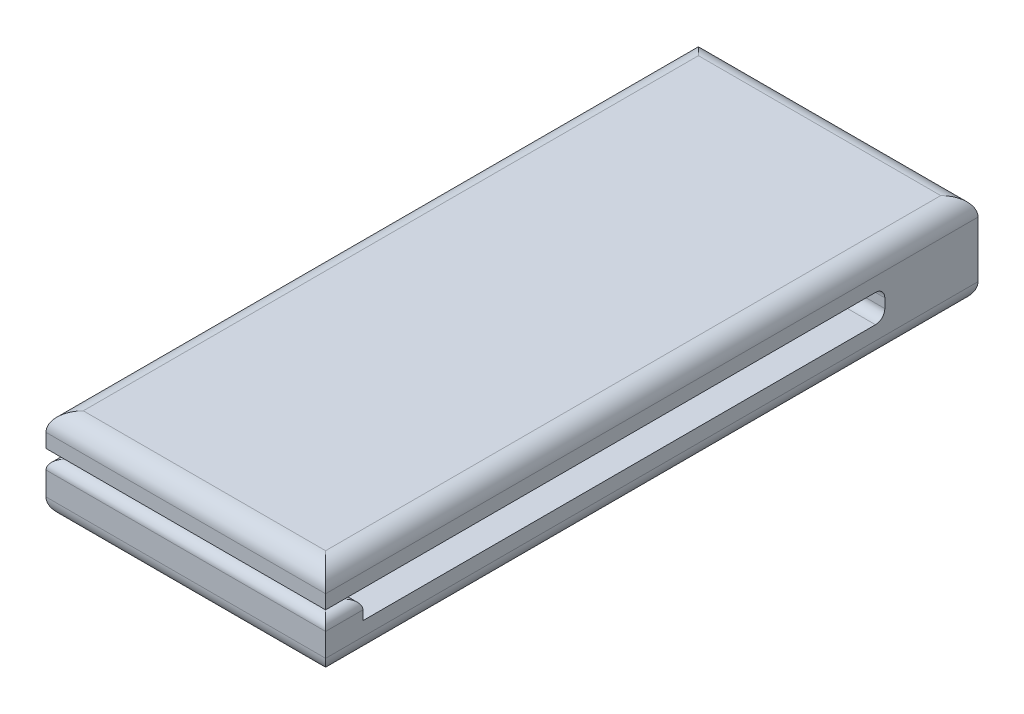
ISO-10303-21;
HEADER;
FILE_DESCRIPTION(('STEP AP214'),'2;1');
FILE_NAME('part.step','',(''),(''),'','','');
FILE_SCHEMA(('AUTOMOTIVE_DESIGN { 1 0 10303 214 1 1 1 1 }'));
ENDSEC;
DATA;
#1=APPLICATION_CONTEXT('core data for automotive mechanical design processes');
#2=APPLICATION_PROTOCOL_DEFINITION('international standard','automotive_design',2000,#1);
#3=PRODUCT_CONTEXT('',#1,'mechanical');
#4=PRODUCT('Part','Part','',(#3));
#5=PRODUCT_RELATED_PRODUCT_CATEGORY('part','',(#4));
#6=PRODUCT_DEFINITION_FORMATION('','',#4);
#7=PRODUCT_DEFINITION_CONTEXT('part definition',#1,'design');
#8=PRODUCT_DEFINITION('design','',#6,#7);
#9=PRODUCT_DEFINITION_SHAPE('','',#8);
#10=(LENGTH_UNIT() NAMED_UNIT(*) SI_UNIT(.MILLI.,.METRE.));
#11=(NAMED_UNIT(*) PLANE_ANGLE_UNIT() SI_UNIT($,.RADIAN.));
#12=(NAMED_UNIT(*) SI_UNIT($,.STERADIAN.) SOLID_ANGLE_UNIT());
#13=UNCERTAINTY_MEASURE_WITH_UNIT(LENGTH_MEASURE(1.E-05),#10,'distance_accuracy_value','');
#14=(GEOMETRIC_REPRESENTATION_CONTEXT(3) GLOBAL_UNCERTAINTY_ASSIGNED_CONTEXT((#13)) GLOBAL_UNIT_ASSIGNED_CONTEXT((#10,
#11,#12)) REPRESENTATION_CONTEXT('',''));
#15=CARTESIAN_POINT('',(0.,0.,0.));
#16=DIRECTION('',(0.,0.,1.));
#17=DIRECTION('',(1.,0.,0.));
#18=AXIS2_PLACEMENT_3D('',#15,#16,#17);
#19=CARTESIAN_POINT('',(-7.5,5.,17.5));
#20=DIRECTION('',(0.,0.,-1.));
#21=DIRECTION('',(-1.,0.,0.));
#22=AXIS2_PLACEMENT_3D('',#19,#20,#21);
#23=PLANE('',#22);
#24=DIRECTION('',(0.,-1.,0.));
#25=VECTOR('',#24,1.);
#26=CARTESIAN_POINT('',(7.5,5.,17.5));
#27=LINE('',#26,#25);
#28=CARTESIAN_POINT('',(7.5,2.25,17.5));
#29=VERTEX_POINT('',#28);
#30=CARTESIAN_POINT('',(7.5,1.,17.5));
#31=VERTEX_POINT('',#30);
#32=EDGE_CURVE('E363',#29,#31,#27,.T.);
#33=ORIENTED_EDGE('',*,*,#32,.F.);
#34=DIRECTION('',(1.,0.,0.));
#35=VECTOR('',#34,1.);
#36=CARTESIAN_POINT('',(-7.5,2.25,17.5));
#37=LINE('',#36,#35);
#38=CARTESIAN_POINT('',(-7.5,2.25,17.5));
#39=VERTEX_POINT('',#38);
#40=EDGE_CURVE('E329',#29,#39,#37,.F.);
#41=ORIENTED_EDGE('',*,*,#40,.T.);
#42=DIRECTION('',(0.,-1.,0.));
#43=VECTOR('',#42,1.);
#44=CARTESIAN_POINT('',(-7.5,5.,17.5));
#45=LINE('',#44,#43);
#46=CARTESIAN_POINT('',(-7.5,1.,17.5));
#47=VERTEX_POINT('',#46);
#48=EDGE_CURVE('E193',#39,#47,#45,.T.);
#49=ORIENTED_EDGE('',*,*,#48,.T.);
#50=DIRECTION('',(1.,0.,0.));
#51=VECTOR('',#50,1.);
#52=CARTESIAN_POINT('',(7.5,1.,17.5));
#53=LINE('',#52,#51);
#54=EDGE_CURVE('E269',#47,#31,#53,.T.);
#55=ORIENTED_EDGE('',*,*,#54,.T.);
#56=EDGE_LOOP('',(#33,#41,#49,#55));
#57=FACE_BOUND('',#56,.T.);
#58=ADVANCED_FACE('F39',(#57),#23,.F.);
#59=CARTESIAN_POINT('',(7.5,1.75,-12.5));
#60=DIRECTION('',(0.,-1.,0.));
#61=DIRECTION('',(1.,0.,0.));
#62=AXIS2_PLACEMENT_3D('',#59,#60,#61);
#63=PLANE('',#62);
#64=DIRECTION('',(-1.,0.,0.));
#65=VECTOR('',#64,1.);
#66=CARTESIAN_POINT('',(-7.5,1.75,15.5));
#67=LINE('',#66,#65);
#68=CARTESIAN_POINT('',(7.5,1.75,15.5));
#69=VERTEX_POINT('',#68);
#70=CARTESIAN_POINT('',(-7.5,1.75,15.5));
#71=VERTEX_POINT('',#70);
#72=EDGE_CURVE('E185',#69,#71,#67,.T.);
#73=ORIENTED_EDGE('',*,*,#72,.F.);
#74=DIRECTION('',(0.,0.,1.));
#75=VECTOR('',#74,1.);
#76=CARTESIAN_POINT('',(7.5,1.75,-12.5));
#77=LINE('',#76,#75);
#78=CARTESIAN_POINT('',(7.5,1.75,-12.));
#79=VERTEX_POINT('',#78);
#80=EDGE_CURVE('E651',#79,#69,#77,.T.);
#81=ORIENTED_EDGE('',*,*,#80,.F.);
#82=DIRECTION('',(1.,0.,0.));
#83=VECTOR('',#82,1.);
#84=CARTESIAN_POINT('',(-7.5,1.75,-12.));
#85=LINE('',#84,#83);
#86=CARTESIAN_POINT('',(-7.5,1.75,-12.));
#87=VERTEX_POINT('',#86);
#88=EDGE_CURVE('E307',#79,#87,#85,.F.);
#89=ORIENTED_EDGE('',*,*,#88,.T.);
#90=DIRECTION('',(0.,0.,1.));
#91=VECTOR('',#90,1.);
#92=CARTESIAN_POINT('',(-7.5,1.75,-12.5));
#93=LINE('',#92,#91);
#94=EDGE_CURVE('E175',#87,#71,#93,.T.);
#95=ORIENTED_EDGE('',*,*,#94,.T.);
#96=EDGE_LOOP('',(#73,#81,#89,#95));
#97=FACE_BOUND('',#96,.T.);
#98=ADVANCED_FACE('F385',(#97),#63,.F.);
#99=CARTESIAN_POINT('',(-7.5,3.25,-12.5));
#100=DIRECTION('',(0.,1.,0.));
#101=DIRECTION('',(0.,0.,1.));
#102=AXIS2_PLACEMENT_3D('',#99,#100,#101);
#103=PLANE('',#102);
#104=DIRECTION('',(0.,0.,1.));
#105=VECTOR('',#104,1.);
#106=CARTESIAN_POINT('',(7.5,3.25,-12.5));
#107=LINE('',#106,#105);
#108=CARTESIAN_POINT('',(7.5,3.25,-12.));
#109=VERTEX_POINT('',#108);
#110=CARTESIAN_POINT('',(7.5,3.25,17.5));
#111=VERTEX_POINT('',#110);
#112=EDGE_CURVE('E176',#109,#111,#107,.T.);
#113=ORIENTED_EDGE('',*,*,#112,.T.);
#114=DIRECTION('',(1.,0.,0.));
#115=VECTOR('',#114,1.);
#116=CARTESIAN_POINT('',(-7.5,3.25,17.5));
#117=LINE('',#116,#115);
#118=CARTESIAN_POINT('',(-7.5,3.25,17.5));
#119=VERTEX_POINT('',#118);
#120=EDGE_CURVE('E179',#119,#111,#117,.T.);
#121=ORIENTED_EDGE('',*,*,#120,.F.);
#122=DIRECTION('',(0.,0.,1.));
#123=VECTOR('',#122,1.);
#124=CARTESIAN_POINT('',(-7.5,3.25,-12.5));
#125=LINE('',#124,#123);
#126=CARTESIAN_POINT('',(-7.5,3.25,-12.));
#127=VERTEX_POINT('',#126);
#128=EDGE_CURVE('E164',#127,#119,#125,.T.);
#129=ORIENTED_EDGE('',*,*,#128,.F.);
#130=DIRECTION('',(-1.,0.,0.));
#131=VECTOR('',#130,1.);
#132=CARTESIAN_POINT('',(7.5,3.25,-12.));
#133=LINE('',#132,#131);
#134=EDGE_CURVE('E294',#127,#109,#133,.F.);
#135=ORIENTED_EDGE('',*,*,#134,.T.);
#136=EDGE_LOOP('',(#113,#121,#129,#135));
#137=FACE_BOUND('',#136,.T.);
#138=ADVANCED_FACE('F180',(#137),#103,.F.);
#139=CARTESIAN_POINT('',(7.5,5.,17.5));
#140=DIRECTION('',(-1.,0.,0.));
#141=DIRECTION('',(0.,0.,1.));
#142=AXIS2_PLACEMENT_3D('',#139,#140,#141);
#143=PLANE('',#142);
#144=DIRECTION('',(0.,-1.,0.));
#145=VECTOR('',#144,1.);
#146=CARTESIAN_POINT('',(7.5,3.25,15.5));
#147=LINE('',#146,#145);
#148=CARTESIAN_POINT('',(7.5,2.25,15.5));
#149=VERTEX_POINT('',#148);
#150=EDGE_CURVE('E281',#149,#69,#147,.T.);
#151=ORIENTED_EDGE('',*,*,#150,.F.);
#152=DIRECTION('',(0.,0.,-1.));
#153=VECTOR('',#152,1.);
#154=CARTESIAN_POINT('',(7.5,2.25,17.5));
#155=LINE('',#154,#153);
#156=EDGE_CURVE('E11',#149,#29,#155,.F.);
#157=ORIENTED_EDGE('',*,*,#156,.T.);
#158=ORIENTED_EDGE('',*,*,#32,.T.);
#159=DIRECTION('',(0.,0.,-1.));
#160=VECTOR('',#159,1.);
#161=CARTESIAN_POINT('',(7.5,1.,-17.5));
#162=LINE('',#161,#160);
#163=CARTESIAN_POINT('',(7.5,1.,-17.5));
#164=VERTEX_POINT('',#163);
#165=EDGE_CURVE('E273',#31,#164,#162,.T.);
#166=ORIENTED_EDGE('',*,*,#165,.T.);
#167=DIRECTION('',(0.,-1.,0.));
#168=VECTOR('',#167,1.);
#169=CARTESIAN_POINT('',(7.5,5.,-17.5));
#170=LINE('',#169,#168);
#171=CARTESIAN_POINT('',(7.5,4.,-17.5));
#172=VERTEX_POINT('',#171);
#173=EDGE_CURVE('E198',#172,#164,#170,.T.);
#174=ORIENTED_EDGE('',*,*,#173,.F.);
#175=DIRECTION('',(0.,0.,-1.));
#176=VECTOR('',#175,1.);
#177=CARTESIAN_POINT('',(7.5,4.,17.5));
#178=LINE('',#177,#176);
#179=CARTESIAN_POINT('',(7.5,4.,17.5));
#180=VERTEX_POINT('',#179);
#181=EDGE_CURVE('E228',#172,#180,#178,.F.);
#182=ORIENTED_EDGE('',*,*,#181,.T.);
#183=EDGE_CURVE('E200',#180,#111,#27,.T.);
#184=ORIENTED_EDGE('',*,*,#183,.T.);
#185=ORIENTED_EDGE('',*,*,#112,.F.);
#186=CARTESIAN_POINT('',(7.5,2.75,-12.));
#187=DIRECTION('',(-1.,0.,0.));
#188=DIRECTION('',(0.,0.,1.));
#189=AXIS2_PLACEMENT_3D('',#186,#187,#188);
#190=CIRCLE('',#189,0.5);
#191=CARTESIAN_POINT('',(7.5,2.75,-12.5));
#192=VERTEX_POINT('',#191);
#193=EDGE_CURVE('E299',#109,#192,#190,.T.);
#194=ORIENTED_EDGE('',*,*,#193,.T.);
#195=DIRECTION('',(0.,1.,0.));
#196=VECTOR('',#195,1.);
#197=CARTESIAN_POINT('',(7.5,3.25,-12.5));
#198=LINE('',#197,#196);
#199=CARTESIAN_POINT('',(7.5,2.25,-12.5));
#200=VERTEX_POINT('',#199);
#201=EDGE_CURVE('E248',#200,#192,#198,.T.);
#202=ORIENTED_EDGE('',*,*,#201,.F.);
#203=CARTESIAN_POINT('',(7.5,2.25,-12.));
#204=DIRECTION('',(-1.,0.,0.));
#205=DIRECTION('',(0.,0.,1.));
#206=AXIS2_PLACEMENT_3D('',#203,#204,#205);
#207=CIRCLE('',#206,0.5);
#208=EDGE_CURVE('E310',#200,#79,#207,.T.);
#209=ORIENTED_EDGE('',*,*,#208,.T.);
#210=ORIENTED_EDGE('',*,*,#80,.T.);
#211=EDGE_LOOP('',(#151,#157,#158,#166,#174,#182,#184,#185,#194,#202,#209,#210));
#212=FACE_BOUND('',#211,.T.);
#213=ADVANCED_FACE('F362',(#212),#143,.F.);
#214=CARTESIAN_POINT('',(-7.5,5.,-17.5));
#215=DIRECTION('',(0.,0.,1.));
#216=DIRECTION('',(1.,0.,0.));
#217=AXIS2_PLACEMENT_3D('',#214,#215,#216);
#218=PLANE('',#217);
#219=ORIENTED_EDGE('',*,*,#173,.T.);
#220=DIRECTION('',(-1.,0.,0.));
#221=VECTOR('',#220,1.);
#222=CARTESIAN_POINT('',(-7.5,1.,-17.5));
#223=LINE('',#222,#221);
#224=CARTESIAN_POINT('',(-7.5,1.,-17.5));
#225=VERTEX_POINT('',#224);
#226=EDGE_CURVE('E232',#164,#225,#223,.T.);
#227=ORIENTED_EDGE('',*,*,#226,.T.);
#228=DIRECTION('',(0.,-1.,0.));
#229=VECTOR('',#228,1.);
#230=CARTESIAN_POINT('',(-7.5,5.,-17.5));
#231=LINE('',#230,#229);
#232=CARTESIAN_POINT('',(-7.5,4.,-17.5));
#233=VERTEX_POINT('',#232);
#234=EDGE_CURVE('E192',#233,#225,#231,.T.);
#235=ORIENTED_EDGE('',*,*,#234,.F.);
#236=DIRECTION('',(-1.,0.,0.));
#237=VECTOR('',#236,1.);
#238=CARTESIAN_POINT('',(-7.5,4.,-17.5));
#239=LINE('',#238,#237);
#240=EDGE_CURVE('E225',#233,#172,#239,.F.);
#241=ORIENTED_EDGE('',*,*,#240,.T.);
#242=EDGE_LOOP('',(#219,#227,#235,#241));
#243=FACE_BOUND('',#242,.T.);
#244=ADVANCED_FACE('F403',(#243),#218,.F.);
#245=CARTESIAN_POINT('',(-7.5,5.,17.5));
#246=DIRECTION('',(1.,0.,0.));
#247=DIRECTION('',(0.,0.,-1.));
#248=AXIS2_PLACEMENT_3D('',#245,#246,#247);
#249=PLANE('',#248);
#250=ORIENTED_EDGE('',*,*,#48,.F.);
#251=DIRECTION('',(0.,0.,-1.));
#252=VECTOR('',#251,1.);
#253=CARTESIAN_POINT('',(-7.5,2.25,17.5));
#254=LINE('',#253,#252);
#255=CARTESIAN_POINT('',(-7.5,2.25,15.5));
#256=VERTEX_POINT('',#255);
#257=EDGE_CURVE('E64',#39,#256,#254,.T.);
#258=ORIENTED_EDGE('',*,*,#257,.T.);
#259=DIRECTION('',(0.,-1.,0.));
#260=VECTOR('',#259,1.);
#261=CARTESIAN_POINT('',(-7.5,3.25,15.5));
#262=LINE('',#261,#260);
#263=EDGE_CURVE('E661',#256,#71,#262,.T.);
#264=ORIENTED_EDGE('',*,*,#263,.T.);
#265=ORIENTED_EDGE('',*,*,#94,.F.);
#266=CARTESIAN_POINT('',(-7.5,2.25,-12.));
#267=DIRECTION('',(1.,0.,0.));
#268=DIRECTION('',(0.,0.,-1.));
#269=AXIS2_PLACEMENT_3D('',#266,#267,#268);
#270=CIRCLE('',#269,0.5);
#271=CARTESIAN_POINT('',(-7.5,2.25,-12.5));
#272=VERTEX_POINT('',#271);
#273=EDGE_CURVE('E313',#87,#272,#270,.T.);
#274=ORIENTED_EDGE('',*,*,#273,.T.);
#275=DIRECTION('',(0.,-1.,0.));
#276=VECTOR('',#275,1.);
#277=CARTESIAN_POINT('',(-7.5,1.75,-12.5));
#278=LINE('',#277,#276);
#279=CARTESIAN_POINT('',(-7.5,2.75,-12.5));
#280=VERTEX_POINT('',#279);
#281=EDGE_CURVE('E654',#280,#272,#278,.T.);
#282=ORIENTED_EDGE('',*,*,#281,.F.);
#283=CARTESIAN_POINT('',(-7.5,2.75,-12.));
#284=DIRECTION('',(1.,0.,0.));
#285=DIRECTION('',(0.,0.,-1.));
#286=AXIS2_PLACEMENT_3D('',#283,#284,#285);
#287=CIRCLE('',#286,0.5);
#288=EDGE_CURVE('E171',#280,#127,#287,.T.);
#289=ORIENTED_EDGE('',*,*,#288,.T.);
#290=ORIENTED_EDGE('',*,*,#128,.T.);
#291=CARTESIAN_POINT('',(-7.5,4.,17.5));
#292=VERTEX_POINT('',#291);
#293=EDGE_CURVE('E168',#292,#119,#45,.T.);
#294=ORIENTED_EDGE('',*,*,#293,.F.);
#295=DIRECTION('',(0.,0.,1.));
#296=VECTOR('',#295,1.);
#297=CARTESIAN_POINT('',(-7.5,4.,17.5));
#298=LINE('',#297,#296);
#299=EDGE_CURVE('E222',#292,#233,#298,.F.);
#300=ORIENTED_EDGE('',*,*,#299,.T.);
#301=ORIENTED_EDGE('',*,*,#234,.T.);
#302=DIRECTION('',(0.,0.,1.));
#303=VECTOR('',#302,1.);
#304=CARTESIAN_POINT('',(-7.5,1.,17.5));
#305=LINE('',#304,#303);
#306=EDGE_CURVE('E265',#225,#47,#305,.T.);
#307=ORIENTED_EDGE('',*,*,#306,.T.);
#308=EDGE_LOOP('',(#250,#258,#264,#265,#274,#282,#289,#290,#294,#300,#301,#307));
#309=FACE_BOUND('',#308,.T.);
#310=ADVANCED_FACE('F166',(#309),#249,.F.);
#311=ORIENTED_EDGE('',*,*,#293,.T.);
#312=ORIENTED_EDGE('',*,*,#120,.T.);
#313=ORIENTED_EDGE('',*,*,#183,.F.);
#314=DIRECTION('',(1.,0.,0.));
#315=VECTOR('',#314,1.);
#316=CARTESIAN_POINT('',(-7.5,4.,17.5));
#317=LINE('',#316,#315);
#318=EDGE_CURVE('E190',#180,#292,#317,.F.);
#319=ORIENTED_EDGE('',*,*,#318,.T.);
#320=EDGE_LOOP('',(#311,#312,#313,#319));
#321=FACE_BOUND('',#320,.T.);
#322=ADVANCED_FACE('F188',(#321),#23,.F.);
#323=CARTESIAN_POINT('',(0.,5.,0.));
#324=DIRECTION('',(0.,-1.,0.));
#325=DIRECTION('',(0.,0.,-1.));
#326=AXIS2_PLACEMENT_3D('',#323,#324,#325);
#327=PLANE('',#326);
#328=DIRECTION('',(0.,0.,1.));
#329=VECTOR('',#328,1.);
#330=CARTESIAN_POINT('',(-6.5,5.,0.));
#331=LINE('',#330,#329);
#332=CARTESIAN_POINT('',(-6.5,5.,-16.5));
#333=VERTEX_POINT('',#332);
#334=CARTESIAN_POINT('',(-6.5,5.,16.5));
#335=VERTEX_POINT('',#334);
#336=EDGE_CURVE('E213',#333,#335,#331,.T.);
#337=ORIENTED_EDGE('',*,*,#336,.T.);
#338=DIRECTION('',(1.,0.,0.));
#339=VECTOR('',#338,1.);
#340=CARTESIAN_POINT('',(0.,5.,16.5));
#341=LINE('',#340,#339);
#342=CARTESIAN_POINT('',(6.5,5.,16.5));
#343=VERTEX_POINT('',#342);
#344=EDGE_CURVE('E216',#335,#343,#341,.T.);
#345=ORIENTED_EDGE('',*,*,#344,.T.);
#346=DIRECTION('',(0.,0.,-1.));
#347=VECTOR('',#346,1.);
#348=CARTESIAN_POINT('',(6.5,5.,0.));
#349=LINE('',#348,#347);
#350=CARTESIAN_POINT('',(6.5,5.,-16.5));
#351=VERTEX_POINT('',#350);
#352=EDGE_CURVE('E207',#343,#351,#349,.T.);
#353=ORIENTED_EDGE('',*,*,#352,.T.);
#354=DIRECTION('',(-1.,0.,0.));
#355=VECTOR('',#354,1.);
#356=CARTESIAN_POINT('',(0.,5.,-16.5));
#357=LINE('',#356,#355);
#358=EDGE_CURVE('E210',#351,#333,#357,.T.);
#359=ORIENTED_EDGE('',*,*,#358,.T.);
#360=EDGE_LOOP('',(#337,#345,#353,#359));
#361=FACE_BOUND('',#360,.T.);
#362=ADVANCED_FACE('F395',(#361),#327,.F.);
#363=CARTESIAN_POINT('',(0.,0.,0.));
#364=DIRECTION('',(0.,-1.,0.));
#365=DIRECTION('',(0.,0.,-1.));
#366=AXIS2_PLACEMENT_3D('',#363,#364,#365);
#367=PLANE('',#366);
#368=DIRECTION('',(0.,0.,1.));
#369=VECTOR('',#368,1.);
#370=CARTESIAN_POINT('',(-6.5,0.,-17.5));
#371=LINE('',#370,#369);
#372=CARTESIAN_POINT('',(-6.5,0.,16.5));
#373=VERTEX_POINT('',#372);
#374=CARTESIAN_POINT('',(-6.5,0.,-16.5));
#375=VERTEX_POINT('',#374);
#376=EDGE_CURVE('E258',#373,#375,#371,.F.);
#377=ORIENTED_EDGE('',*,*,#376,.T.);
#378=DIRECTION('',(-1.,0.,0.));
#379=VECTOR('',#378,1.);
#380=CARTESIAN_POINT('',(7.5,0.,-16.5));
#381=LINE('',#380,#379);
#382=CARTESIAN_POINT('',(6.5,0.,-16.5));
#383=VERTEX_POINT('',#382);
#384=EDGE_CURVE('E261',#375,#383,#381,.F.);
#385=ORIENTED_EDGE('',*,*,#384,.T.);
#386=DIRECTION('',(0.,0.,-1.));
#387=VECTOR('',#386,1.);
#388=CARTESIAN_POINT('',(6.5,0.,17.5));
#389=LINE('',#388,#387);
#390=CARTESIAN_POINT('',(6.5,0.,16.5));
#391=VERTEX_POINT('',#390);
#392=EDGE_CURVE('E252',#383,#391,#389,.F.);
#393=ORIENTED_EDGE('',*,*,#392,.T.);
#394=DIRECTION('',(1.,0.,0.));
#395=VECTOR('',#394,1.);
#396=CARTESIAN_POINT('',(-7.5,0.,16.5));
#397=LINE('',#396,#395);
#398=EDGE_CURVE('E255',#391,#373,#397,.F.);
#399=ORIENTED_EDGE('',*,*,#398,.T.);
#400=EDGE_LOOP('',(#377,#385,#393,#399));
#401=FACE_BOUND('',#400,.T.);
#402=ADVANCED_FACE('F400',(#401),#367,.T.);
#403=CARTESIAN_POINT('',(0.,0.,-12.5));
#404=DIRECTION('',(0.,0.,-1.));
#405=DIRECTION('',(-1.,0.,0.));
#406=AXIS2_PLACEMENT_3D('',#403,#404,#405);
#407=PLANE('',#406);
#408=ORIENTED_EDGE('',*,*,#281,.T.);
#409=DIRECTION('',(1.,0.,0.));
#410=VECTOR('',#409,1.);
#411=CARTESIAN_POINT('',(7.5,2.25,-12.5));
#412=LINE('',#411,#410);
#413=EDGE_CURVE('E303',#272,#200,#412,.T.);
#414=ORIENTED_EDGE('',*,*,#413,.T.);
#415=ORIENTED_EDGE('',*,*,#201,.T.);
#416=DIRECTION('',(-1.,0.,0.));
#417=VECTOR('',#416,1.);
#418=CARTESIAN_POINT('',(-7.5,2.75,-12.5));
#419=LINE('',#418,#417);
#420=EDGE_CURVE('E276',#192,#280,#419,.T.);
#421=ORIENTED_EDGE('',*,*,#420,.T.);
#422=EDGE_LOOP('',(#408,#414,#415,#421));
#423=FACE_BOUND('',#422,.T.);
#424=ADVANCED_FACE('F428',(#423),#407,.F.);
#425=CARTESIAN_POINT('',(0.,4.,-16.5));
#426=DIRECTION('',(-1.,0.,0.));
#427=DIRECTION('',(0.,0.,1.));
#428=AXIS2_PLACEMENT_3D('',#425,#426,#427);
#429=CYLINDRICAL_SURFACE('',#428,1.);
#430=CARTESIAN_POINT('',(6.5,4.,-16.5));
#431=DIRECTION('',(-0.707106781186547,0.,-0.707106781186547));
#432=DIRECTION('',(0.707106781186547,0.,-0.707106781186547));
#433=AXIS2_PLACEMENT_3D('',#430,#431,#432);
#434=ELLIPSE('',#433,1.41421356237309,1.);
#435=EDGE_CURVE('E240',#172,#351,#434,.F.);
#436=ORIENTED_EDGE('',*,*,#435,.F.);
#437=ORIENTED_EDGE('',*,*,#240,.F.);
#438=CARTESIAN_POINT('',(-6.5,4.,-16.5));
#439=DIRECTION('',(-0.707106781186547,0.,0.707106781186547));
#440=DIRECTION('',(-0.707106781186547,0.,-0.707106781186547));
#441=AXIS2_PLACEMENT_3D('',#438,#439,#440);
#442=ELLIPSE('',#441,1.41421356237309,1.);
#443=EDGE_CURVE('E244',#333,#233,#442,.T.);
#444=ORIENTED_EDGE('',*,*,#443,.F.);
#445=ORIENTED_EDGE('',*,*,#358,.F.);
#446=EDGE_LOOP('',(#436,#437,#444,#445));
#447=FACE_BOUND('',#446,.T.);
#448=ADVANCED_FACE('F424',(#447),#429,.T.);
#449=CARTESIAN_POINT('',(-6.5,4.,0.));
#450=DIRECTION('',(0.,0.,1.));
#451=DIRECTION('',(1.,0.,0.));
#452=AXIS2_PLACEMENT_3D('',#449,#450,#451);
#453=CYLINDRICAL_SURFACE('',#452,1.);
#454=ORIENTED_EDGE('',*,*,#443,.T.);
#455=ORIENTED_EDGE('',*,*,#299,.F.);
#456=CARTESIAN_POINT('',(-6.5,4.,16.5));
#457=DIRECTION('',(0.707106781186547,0.,0.707106781186547));
#458=DIRECTION('',(-0.707106781186547,0.,0.707106781186547));
#459=AXIS2_PLACEMENT_3D('',#456,#457,#458);
#460=ELLIPSE('',#459,1.41421356237309,1.);
#461=EDGE_CURVE('E236',#335,#292,#460,.T.);
#462=ORIENTED_EDGE('',*,*,#461,.F.);
#463=ORIENTED_EDGE('',*,*,#336,.F.);
#464=EDGE_LOOP('',(#454,#455,#462,#463));
#465=FACE_BOUND('',#464,.T.);
#466=ADVANCED_FACE('F420',(#465),#453,.T.);
#467=CARTESIAN_POINT('',(6.5,4.,0.));
#468=DIRECTION('',(0.,0.,-1.));
#469=DIRECTION('',(-1.,0.,0.));
#470=AXIS2_PLACEMENT_3D('',#467,#468,#469);
#471=CYLINDRICAL_SURFACE('',#470,1.);
#472=ORIENTED_EDGE('',*,*,#435,.T.);
#473=ORIENTED_EDGE('',*,*,#352,.F.);
#474=CARTESIAN_POINT('',(6.5,4.,16.5));
#475=DIRECTION('',(0.707106781186547,0.,-0.707106781186547));
#476=DIRECTION('',(-0.707106781186547,0.,-0.707106781186547));
#477=AXIS2_PLACEMENT_3D('',#474,#475,#476);
#478=ELLIPSE('',#477,1.41421356237309,1.);
#479=EDGE_CURVE('E233',#180,#343,#478,.F.);
#480=ORIENTED_EDGE('',*,*,#479,.F.);
#481=ORIENTED_EDGE('',*,*,#181,.F.);
#482=EDGE_LOOP('',(#472,#473,#480,#481));
#483=FACE_BOUND('',#482,.T.);
#484=ADVANCED_FACE('F416',(#483),#471,.T.);
#485=CARTESIAN_POINT('',(0.,4.,16.5));
#486=DIRECTION('',(1.,0.,0.));
#487=DIRECTION('',(0.,0.,-1.));
#488=AXIS2_PLACEMENT_3D('',#485,#486,#487);
#489=CYLINDRICAL_SURFACE('',#488,1.);
#490=ORIENTED_EDGE('',*,*,#461,.T.);
#491=ORIENTED_EDGE('',*,*,#318,.F.);
#492=ORIENTED_EDGE('',*,*,#479,.T.);
#493=ORIENTED_EDGE('',*,*,#344,.F.);
#494=EDGE_LOOP('',(#490,#491,#492,#493));
#495=FACE_BOUND('',#494,.T.);
#496=ADVANCED_FACE('F412',(#495),#489,.T.);
#497=CARTESIAN_POINT('',(-7.5,1.,16.5));
#498=DIRECTION('',(-1.,0.,0.));
#499=DIRECTION('',(0.,0.,1.));
#500=AXIS2_PLACEMENT_3D('',#497,#498,#499);
#501=CYLINDRICAL_SURFACE('',#500,1.);
#502=CARTESIAN_POINT('',(-6.5,1.,16.5));
#503=DIRECTION('',(-0.707106781186547,0.,-0.707106781186547));
#504=DIRECTION('',(-0.707106781186547,0.,0.707106781186547));
#505=AXIS2_PLACEMENT_3D('',#502,#503,#504);
#506=ELLIPSE('',#505,1.41421356237309,1.);
#507=EDGE_CURVE('E284',#373,#47,#506,.T.);
#508=ORIENTED_EDGE('',*,*,#507,.F.);
#509=ORIENTED_EDGE('',*,*,#398,.F.);
#510=CARTESIAN_POINT('',(6.5,1.,16.5));
#511=DIRECTION('',(-0.707106781186547,0.,0.707106781186547));
#512=DIRECTION('',(0.707106781186547,0.,0.707106781186547));
#513=AXIS2_PLACEMENT_3D('',#510,#511,#512);
#514=ELLIPSE('',#513,1.41421356237309,1.);
#515=EDGE_CURVE('E237',#31,#391,#514,.F.);
#516=ORIENTED_EDGE('',*,*,#515,.F.);
#517=ORIENTED_EDGE('',*,*,#54,.F.);
#518=EDGE_LOOP('',(#508,#509,#516,#517));
#519=FACE_BOUND('',#518,.T.);
#520=ADVANCED_FACE('F415',(#519),#501,.T.);
#521=CARTESIAN_POINT('',(6.5,1.,17.5));
#522=DIRECTION('',(0.,0.,1.));
#523=DIRECTION('',(1.,0.,0.));
#524=AXIS2_PLACEMENT_3D('',#521,#522,#523);
#525=CYLINDRICAL_SURFACE('',#524,1.);
#526=ORIENTED_EDGE('',*,*,#515,.T.);
#527=ORIENTED_EDGE('',*,*,#392,.F.);
#528=CARTESIAN_POINT('',(6.5,1.,-16.5));
#529=DIRECTION('',(0.707106781186547,0.,0.707106781186547));
#530=DIRECTION('',(-0.707106781186547,0.,0.707106781186547));
#531=AXIS2_PLACEMENT_3D('',#528,#529,#530);
#532=ELLIPSE('',#531,1.41421356237309,1.);
#533=EDGE_CURVE('E280',#164,#383,#532,.F.);
#534=ORIENTED_EDGE('',*,*,#533,.F.);
#535=ORIENTED_EDGE('',*,*,#165,.F.);
#536=EDGE_LOOP('',(#526,#527,#534,#535));
#537=FACE_BOUND('',#536,.T.);
#538=ADVANCED_FACE('F438',(#537),#525,.T.);
#539=CARTESIAN_POINT('',(-6.5,1.,17.5));
#540=DIRECTION('',(0.,0.,-1.));
#541=DIRECTION('',(-1.,0.,0.));
#542=AXIS2_PLACEMENT_3D('',#539,#540,#541);
#543=CYLINDRICAL_SURFACE('',#542,1.);
#544=ORIENTED_EDGE('',*,*,#507,.T.);
#545=ORIENTED_EDGE('',*,*,#306,.F.);
#546=CARTESIAN_POINT('',(-6.5,1.,-16.5));
#547=DIRECTION('',(0.707106781186547,0.,-0.707106781186547));
#548=DIRECTION('',(-0.707106781186547,0.,-0.707106781186547));
#549=AXIS2_PLACEMENT_3D('',#546,#547,#548);
#550=ELLIPSE('',#549,1.41421356237309,1.);
#551=EDGE_CURVE('E277',#375,#225,#550,.T.);
#552=ORIENTED_EDGE('',*,*,#551,.F.);
#553=ORIENTED_EDGE('',*,*,#376,.F.);
#554=EDGE_LOOP('',(#544,#545,#552,#553));
#555=FACE_BOUND('',#554,.T.);
#556=ADVANCED_FACE('F434',(#555),#543,.T.);
#557=CARTESIAN_POINT('',(-7.5,1.,-16.5));
#558=DIRECTION('',(1.,0.,0.));
#559=DIRECTION('',(0.,0.,-1.));
#560=AXIS2_PLACEMENT_3D('',#557,#558,#559);
#561=CYLINDRICAL_SURFACE('',#560,1.);
#562=ORIENTED_EDGE('',*,*,#533,.T.);
#563=ORIENTED_EDGE('',*,*,#384,.F.);
#564=ORIENTED_EDGE('',*,*,#551,.T.);
#565=ORIENTED_EDGE('',*,*,#226,.F.);
#566=EDGE_LOOP('',(#562,#563,#564,#565));
#567=FACE_BOUND('',#566,.T.);
#568=ADVANCED_FACE('F430',(#567),#561,.T.);
#569=CARTESIAN_POINT('',(0.,2.75,-12.));
#570=DIRECTION('',(1.,0.,0.));
#571=DIRECTION('',(0.,0.,-1.));
#572=AXIS2_PLACEMENT_3D('',#569,#570,#571);
#573=CYLINDRICAL_SURFACE('',#572,0.5);
#574=ORIENTED_EDGE('',*,*,#193,.F.);
#575=ORIENTED_EDGE('',*,*,#134,.F.);
#576=ORIENTED_EDGE('',*,*,#288,.F.);
#577=ORIENTED_EDGE('',*,*,#420,.F.);
#578=EDGE_LOOP('',(#574,#575,#576,#577));
#579=FACE_BOUND('',#578,.T.);
#580=ADVANCED_FACE('F433',(#579),#573,.F.);
#581=CARTESIAN_POINT('',(0.,2.25,-12.));
#582=DIRECTION('',(-1.,0.,0.));
#583=DIRECTION('',(0.,-1.,0.));
#584=AXIS2_PLACEMENT_3D('',#581,#582,#583);
#585=CYLINDRICAL_SURFACE('',#584,0.5);
#586=ORIENTED_EDGE('',*,*,#273,.F.);
#587=ORIENTED_EDGE('',*,*,#88,.F.);
#588=ORIENTED_EDGE('',*,*,#208,.F.);
#589=ORIENTED_EDGE('',*,*,#413,.F.);
#590=EDGE_LOOP('',(#586,#587,#588,#589));
#591=FACE_BOUND('',#590,.T.);
#592=ADVANCED_FACE('F382',(#591),#585,.F.);
#593=CARTESIAN_POINT('',(-7.5,3.25,15.5));
#594=DIRECTION('',(0.,0.,1.));
#595=DIRECTION('',(1.,0.,0.));
#596=AXIS2_PLACEMENT_3D('',#593,#594,#595);
#597=PLANE('',#596);
#598=ORIENTED_EDGE('',*,*,#263,.F.);
#599=DIRECTION('',(1.,0.,0.));
#600=VECTOR('',#599,1.);
#601=CARTESIAN_POINT('',(-7.5,2.25,15.5));
#602=LINE('',#601,#600);
#603=EDGE_CURVE('E49',#256,#149,#602,.T.);
#604=ORIENTED_EDGE('',*,*,#603,.T.);
#605=ORIENTED_EDGE('',*,*,#150,.T.);
#606=ORIENTED_EDGE('',*,*,#72,.T.);
#607=EDGE_LOOP('',(#598,#604,#605,#606));
#608=FACE_BOUND('',#607,.T.);
#609=ADVANCED_FACE('F376',(#608),#597,.F.);
#610=CARTESIAN_POINT('',(-7.5,2.75,15.5));
#611=DIRECTION('',(0.,-1.,0.));
#612=DIRECTION('',(0.,0.,-1.));
#613=AXIS2_PLACEMENT_3D('',#610,#611,#612);
#614=PLANE('',#613);
#615=DIRECTION('',(0.,0.,-1.));
#616=VECTOR('',#615,1.);
#617=CARTESIAN_POINT('',(-7.,2.75,15.5));
#618=LINE('',#617,#616);
#619=CARTESIAN_POINT('',(-7.,2.75,16.));
#620=VERTEX_POINT('',#619);
#621=CARTESIAN_POINT('',(-7.,2.75,17.));
#622=VERTEX_POINT('',#621);
#623=EDGE_CURVE('E322',#620,#622,#618,.F.);
#624=ORIENTED_EDGE('',*,*,#623,.T.);
#625=DIRECTION('',(1.,0.,0.));
#626=VECTOR('',#625,1.);
#627=CARTESIAN_POINT('',(-7.5,2.75,17.));
#628=LINE('',#627,#626);
#629=CARTESIAN_POINT('',(7.,2.75,17.));
#630=VERTEX_POINT('',#629);
#631=EDGE_CURVE('E325',#622,#630,#628,.T.);
#632=ORIENTED_EDGE('',*,*,#631,.T.);
#633=DIRECTION('',(0.,0.,-1.));
#634=VECTOR('',#633,1.);
#635=CARTESIAN_POINT('',(7.,2.75,15.5));
#636=LINE('',#635,#634);
#637=CARTESIAN_POINT('',(7.,2.75,16.));
#638=VERTEX_POINT('',#637);
#639=EDGE_CURVE('E316',#630,#638,#636,.T.);
#640=ORIENTED_EDGE('',*,*,#639,.T.);
#641=DIRECTION('',(1.,0.,0.));
#642=VECTOR('',#641,1.);
#643=CARTESIAN_POINT('',(-7.5,2.75,16.));
#644=LINE('',#643,#642);
#645=EDGE_CURVE('E319',#638,#620,#644,.F.);
#646=ORIENTED_EDGE('',*,*,#645,.T.);
#647=EDGE_LOOP('',(#624,#632,#640,#646));
#648=FACE_BOUND('',#647,.T.);
#649=ADVANCED_FACE('F374',(#648),#614,.F.);
#650=CARTESIAN_POINT('',(-7.5,2.25,16.));
#651=DIRECTION('',(1.,0.,0.));
#652=DIRECTION('',(0.,0.,-1.));
#653=AXIS2_PLACEMENT_3D('',#650,#651,#652);
#654=CYLINDRICAL_SURFACE('',#653,0.5);
#655=CARTESIAN_POINT('',(7.,2.25,16.));
#656=DIRECTION('',(-0.707106781186547,0.,-0.707106781186547));
#657=DIRECTION('',(0.707106781186547,0.,-0.707106781186547));
#658=AXIS2_PLACEMENT_3D('',#655,#656,#657);
#659=ELLIPSE('',#658,0.707106781186547,0.5);
#660=EDGE_CURVE('E342',#149,#638,#659,.F.);
#661=ORIENTED_EDGE('',*,*,#660,.F.);
#662=ORIENTED_EDGE('',*,*,#603,.F.);
#663=CARTESIAN_POINT('',(-7.,2.25,16.));
#664=DIRECTION('',(0.707106781186547,0.,-0.707106781186547));
#665=DIRECTION('',(0.707106781186547,0.,0.707106781186547));
#666=AXIS2_PLACEMENT_3D('',#663,#664,#665);
#667=ELLIPSE('',#666,0.707106781186547,0.5);
#668=EDGE_CURVE('E43',#620,#256,#667,.F.);
#669=ORIENTED_EDGE('',*,*,#668,.F.);
#670=ORIENTED_EDGE('',*,*,#645,.F.);
#671=EDGE_LOOP('',(#661,#662,#669,#670));
#672=FACE_BOUND('',#671,.T.);
#673=ADVANCED_FACE('F41',(#672),#654,.T.);
#674=CARTESIAN_POINT('',(-7.,2.25,17.5));
#675=DIRECTION('',(0.,0.,-1.));
#676=DIRECTION('',(-1.,0.,0.));
#677=AXIS2_PLACEMENT_3D('',#674,#675,#676);
#678=CYLINDRICAL_SURFACE('',#677,0.5);
#679=ORIENTED_EDGE('',*,*,#668,.T.);
#680=ORIENTED_EDGE('',*,*,#257,.F.);
#681=CARTESIAN_POINT('',(-7.,2.25,17.));
#682=DIRECTION('',(-0.707106781186547,0.,-0.707106781186547));
#683=DIRECTION('',(0.707106781186547,0.,-0.707106781186547));
#684=AXIS2_PLACEMENT_3D('',#681,#682,#683);
#685=ELLIPSE('',#684,0.707106781186547,0.5);
#686=EDGE_CURVE('E340',#622,#39,#685,.F.);
#687=ORIENTED_EDGE('',*,*,#686,.F.);
#688=ORIENTED_EDGE('',*,*,#623,.F.);
#689=EDGE_LOOP('',(#679,#680,#687,#688));
#690=FACE_BOUND('',#689,.T.);
#691=ADVANCED_FACE('F354',(#690),#678,.T.);
#692=CARTESIAN_POINT('',(7.,2.25,15.5));
#693=DIRECTION('',(0.,0.,-1.));
#694=DIRECTION('',(-1.,0.,0.));
#695=AXIS2_PLACEMENT_3D('',#692,#693,#694);
#696=CYLINDRICAL_SURFACE('',#695,0.5);
#697=ORIENTED_EDGE('',*,*,#660,.T.);
#698=ORIENTED_EDGE('',*,*,#639,.F.);
#699=CARTESIAN_POINT('',(7.,2.25,17.));
#700=DIRECTION('',(0.707106781186547,0.,-0.707106781186547));
#701=DIRECTION('',(-0.707106781186547,0.,-0.707106781186547));
#702=AXIS2_PLACEMENT_3D('',#699,#700,#701);
#703=ELLIPSE('',#702,0.707106781186547,0.5);
#704=EDGE_CURVE('E337',#29,#630,#703,.F.);
#705=ORIENTED_EDGE('',*,*,#704,.F.);
#706=ORIENTED_EDGE('',*,*,#156,.F.);
#707=EDGE_LOOP('',(#697,#698,#705,#706));
#708=FACE_BOUND('',#707,.T.);
#709=ADVANCED_FACE('F359',(#708),#696,.T.);
#710=CARTESIAN_POINT('',(-7.5,2.25,17.));
#711=DIRECTION('',(1.,0.,0.));
#712=DIRECTION('',(0.,0.,-1.));
#713=AXIS2_PLACEMENT_3D('',#710,#711,#712);
#714=CYLINDRICAL_SURFACE('',#713,0.5);
#715=ORIENTED_EDGE('',*,*,#686,.T.);
#716=ORIENTED_EDGE('',*,*,#40,.F.);
#717=ORIENTED_EDGE('',*,*,#704,.T.);
#718=ORIENTED_EDGE('',*,*,#631,.F.);
#719=EDGE_LOOP('',(#715,#716,#717,#718));
#720=FACE_BOUND('',#719,.T.);
#721=ADVANCED_FACE('F371',(#720),#714,.T.);
#722=CLOSED_SHELL('',(#58,#98,#138,#213,#244,#310,#322,#362,#402,#424,#448,#466,#484,#496,#520,
#538,#556,#568,#580,#592,#609,#649,#673,#691,#709,#721));
#723=MANIFOLD_SOLID_BREP('B2',#722);
#724=ADVANCED_BREP_SHAPE_REPRESENTATION('',(#18,#723),#14);
#725=SHAPE_DEFINITION_REPRESENTATION(#9,#724);
ENDSEC;
END-ISO-10303-21;
